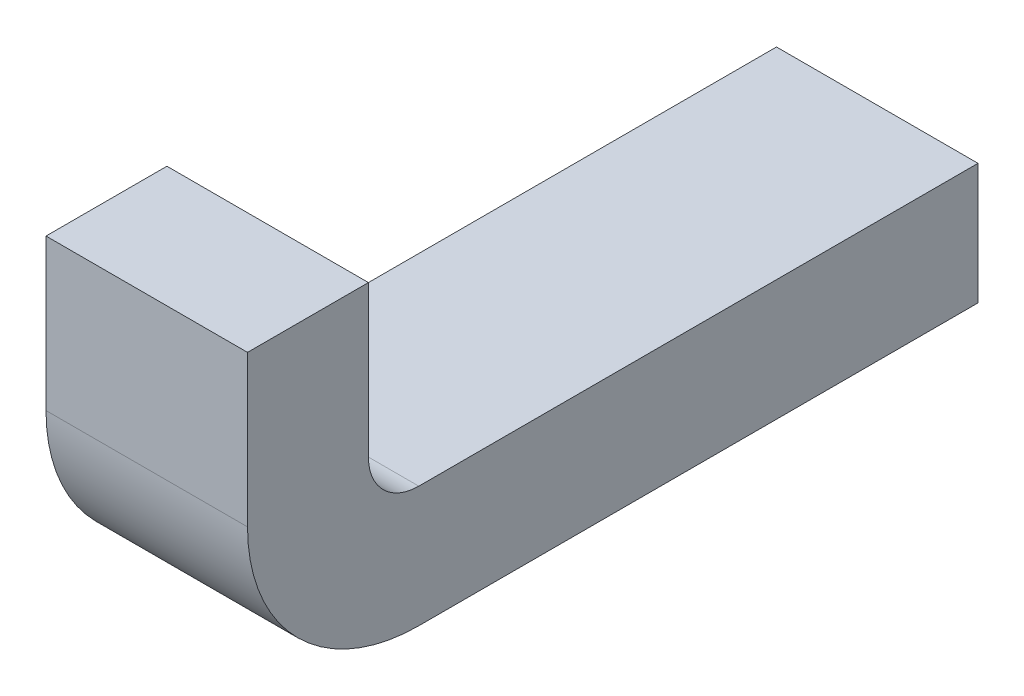
ISO-10303-21;
HEADER;
FILE_DESCRIPTION(('STEP AP214'),'2;1');
FILE_NAME('part.step','',(''),(''),'','','');
FILE_SCHEMA(('AUTOMOTIVE_DESIGN { 1 0 10303 214 1 1 1 1 }'));
ENDSEC;
DATA;
#1=APPLICATION_CONTEXT('core data for automotive mechanical design processes');
#2=APPLICATION_PROTOCOL_DEFINITION('international standard','automotive_design',2000,#1);
#3=PRODUCT_CONTEXT('',#1,'mechanical');
#4=PRODUCT('Part','Part','',(#3));
#5=PRODUCT_RELATED_PRODUCT_CATEGORY('part','',(#4));
#6=PRODUCT_DEFINITION_FORMATION('','',#4);
#7=PRODUCT_DEFINITION_CONTEXT('part definition',#1,'design');
#8=PRODUCT_DEFINITION('design','',#6,#7);
#9=PRODUCT_DEFINITION_SHAPE('','',#8);
#10=(LENGTH_UNIT() NAMED_UNIT(*) SI_UNIT(.MILLI.,.METRE.));
#11=(NAMED_UNIT(*) PLANE_ANGLE_UNIT() SI_UNIT($,.RADIAN.));
#12=(NAMED_UNIT(*) SI_UNIT($,.STERADIAN.) SOLID_ANGLE_UNIT());
#13=UNCERTAINTY_MEASURE_WITH_UNIT(LENGTH_MEASURE(1.E-05),#10,'distance_accuracy_value','');
#14=(GEOMETRIC_REPRESENTATION_CONTEXT(3) GLOBAL_UNCERTAINTY_ASSIGNED_CONTEXT((#13)) GLOBAL_UNIT_ASSIGNED_CONTEXT((#10,
#11,#12)) REPRESENTATION_CONTEXT('',''));
#15=CARTESIAN_POINT('',(0.,0.,0.));
#16=DIRECTION('',(0.,0.,1.));
#17=DIRECTION('',(1.,0.,0.));
#18=AXIS2_PLACEMENT_3D('',#15,#16,#17);
#19=CARTESIAN_POINT('',(-1.85,0.,-3.300000000002));
#20=DIRECTION('',(0.,-1.,0.));
#21=DIRECTION('',(1.,0.,0.));
#22=AXIS2_PLACEMENT_3D('',#19,#20,#21);
#23=PLANE('',#22);
#24=DIRECTION('',(0.,0.,1.));
#25=VECTOR('',#24,1.);
#26=CARTESIAN_POINT('',(-1.85,0.,-3.300000000002));
#27=LINE('',#26,#25);
#28=CARTESIAN_POINT('',(-1.85,0.,-3.300000000002));
#29=VERTEX_POINT('',#28);
#30=CARTESIAN_POINT('',(-1.85,0.,-3.854999999999));
#31=VERTEX_POINT('',#30);
#32=EDGE_CURVE('E121',#29,#31,#27,.F.);
#33=ORIENTED_EDGE('',*,*,#32,.T.);
#34=DIRECTION('',(-1.,0.,0.));
#35=VECTOR('',#34,1.);
#36=CARTESIAN_POINT('',(-1.85,0.,-3.854999999999));
#37=LINE('',#36,#35);
#38=CARTESIAN_POINT('',(-1.65,0.,-3.854999999999));
#39=VERTEX_POINT('',#38);
#40=EDGE_CURVE('E124',#39,#31,#37,.T.);
#41=ORIENTED_EDGE('',*,*,#40,.F.);
#42=DIRECTION('',(0.,0.,1.));
#43=VECTOR('',#42,1.);
#44=CARTESIAN_POINT('',(-1.65,0.,-3.300000000002));
#45=LINE('',#44,#43);
#46=CARTESIAN_POINT('',(-1.65,0.,-3.300000000002));
#47=VERTEX_POINT('',#46);
#48=EDGE_CURVE('E154',#47,#39,#45,.F.);
#49=ORIENTED_EDGE('',*,*,#48,.F.);
#50=DIRECTION('',(1.,0.,0.));
#51=VECTOR('',#50,1.);
#52=CARTESIAN_POINT('',(-1.85,0.,-3.300000000002));
#53=LINE('',#52,#51);
#54=EDGE_CURVE('E63',#29,#47,#53,.T.);
#55=ORIENTED_EDGE('',*,*,#54,.F.);
#56=EDGE_LOOP('',(#33,#41,#49,#55));
#57=FACE_BOUND('',#56,.T.);
#58=ADVANCED_FACE('F16',(#57),#23,.T.);
#59=CARTESIAN_POINT('',(-1.85,0.32,-3.250000000002));
#60=DIRECTION('',(0.,1.,1.246832498358E-13));
#61=DIRECTION('',(0.,-1.246832498358E-13,1.));
#62=AXIS2_PLACEMENT_3D('',#59,#60,#61);
#63=PLANE('',#62);
#64=DIRECTION('',(0.,0.,1.));
#65=VECTOR('',#64,1.);
#66=CARTESIAN_POINT('',(-1.85,0.32,-3.300000000002));
#67=LINE('',#66,#65);
#68=CARTESIAN_POINT('',(-1.85,0.32,-3.250000000002));
#69=VERTEX_POINT('',#68);
#70=CARTESIAN_POINT('',(-1.85,0.32,-3.130000000002));
#71=VERTEX_POINT('',#70);
#72=EDGE_CURVE('E100',#69,#71,#67,.T.);
#73=ORIENTED_EDGE('',*,*,#72,.T.);
#74=DIRECTION('',(1.,0.,0.));
#75=VECTOR('',#74,1.);
#76=CARTESIAN_POINT('',(-1.85,0.32,-3.130000000002));
#77=LINE('',#76,#75);
#78=CARTESIAN_POINT('',(-1.65,0.32,-3.130000000002));
#79=VERTEX_POINT('',#78);
#80=EDGE_CURVE('E162',#79,#71,#77,.F.);
#81=ORIENTED_EDGE('',*,*,#80,.F.);
#82=DIRECTION('',(0.,0.,1.));
#83=VECTOR('',#82,1.);
#84=CARTESIAN_POINT('',(-1.65,0.32,-3.300000000002));
#85=LINE('',#84,#83);
#86=CARTESIAN_POINT('',(-1.65,0.32,-3.250000000002));
#87=VERTEX_POINT('',#86);
#88=EDGE_CURVE('E150',#87,#79,#85,.T.);
#89=ORIENTED_EDGE('',*,*,#88,.F.);
#90=DIRECTION('',(-1.,0.,0.));
#91=VECTOR('',#90,1.);
#92=CARTESIAN_POINT('',(-1.85,0.32,-3.250000000002));
#93=LINE('',#92,#91);
#94=EDGE_CURVE('E72',#69,#87,#93,.F.);
#95=ORIENTED_EDGE('',*,*,#94,.F.);
#96=EDGE_LOOP('',(#73,#81,#89,#95));
#97=FACE_BOUND('',#96,.T.);
#98=ADVANCED_FACE('F182',(#97),#63,.T.);
#99=CARTESIAN_POINT('',(-1.85,0.32,-3.130000000002));
#100=DIRECTION('',(0.,0.,1.));
#101=DIRECTION('',(1.,0.,0.));
#102=AXIS2_PLACEMENT_3D('',#99,#100,#101);
#103=PLANE('',#102);
#104=DIRECTION('',(0.,1.,0.));
#105=VECTOR('',#104,1.);
#106=CARTESIAN_POINT('',(-1.85,0.17,-3.130000000002));
#107=LINE('',#106,#105);
#108=CARTESIAN_POINT('',(-1.85,0.17,-3.130000000002));
#109=VERTEX_POINT('',#108);
#110=EDGE_CURVE('E110',#71,#109,#107,.F.);
#111=ORIENTED_EDGE('',*,*,#110,.T.);
#112=DIRECTION('',(1.,0.,0.));
#113=VECTOR('',#112,1.);
#114=CARTESIAN_POINT('',(-1.85,0.17,-3.130000000002));
#115=LINE('',#114,#113);
#116=CARTESIAN_POINT('',(-1.65,0.17,-3.130000000002));
#117=VERTEX_POINT('',#116);
#118=EDGE_CURVE('E57',#117,#109,#115,.F.);
#119=ORIENTED_EDGE('',*,*,#118,.F.);
#120=DIRECTION('',(0.,1.,0.));
#121=VECTOR('',#120,1.);
#122=CARTESIAN_POINT('',(-1.65,0.17,-3.130000000002));
#123=LINE('',#122,#121);
#124=EDGE_CURVE('E141',#79,#117,#123,.F.);
#125=ORIENTED_EDGE('',*,*,#124,.F.);
#126=ORIENTED_EDGE('',*,*,#80,.T.);
#127=EDGE_LOOP('',(#111,#119,#125,#126));
#128=FACE_BOUND('',#127,.T.);
#129=ADVANCED_FACE('F183',(#128),#103,.T.);
#130=CARTESIAN_POINT('',(-1.85,0.17,-3.300000000002));
#131=DIRECTION('',(1.,0.,0.));
#132=DIRECTION('',(0.,1.,0.));
#133=AXIS2_PLACEMENT_3D('',#130,#131,#132);
#134=CYLINDRICAL_SURFACE('',#133,0.17);
#135=CARTESIAN_POINT('',(-1.85,0.17,-3.300000000002));
#136=DIRECTION('',(1.,0.,0.));
#137=DIRECTION('',(0.,1.,0.));
#138=AXIS2_PLACEMENT_3D('',#135,#136,#137);
#139=CIRCLE('',#138,0.17);
#140=EDGE_CURVE('E96',#109,#29,#139,.T.);
#141=ORIENTED_EDGE('',*,*,#140,.T.);
#142=ORIENTED_EDGE('',*,*,#54,.T.);
#143=CARTESIAN_POINT('',(-1.65,0.17,-3.300000000002));
#144=DIRECTION('',(1.,0.,0.));
#145=DIRECTION('',(0.,1.,0.));
#146=AXIS2_PLACEMENT_3D('',#143,#144,#145);
#147=CIRCLE('',#146,0.17);
#148=EDGE_CURVE('E19',#117,#47,#147,.T.);
#149=ORIENTED_EDGE('',*,*,#148,.F.);
#150=ORIENTED_EDGE('',*,*,#118,.T.);
#151=EDGE_LOOP('',(#141,#142,#149,#150));
#152=FACE_BOUND('',#151,.T.);
#153=ADVANCED_FACE('F185',(#152),#134,.T.);
#154=CARTESIAN_POINT('',(-1.85,0.17,-3.250000000002));
#155=DIRECTION('',(0.,0.,-1.));
#156=DIRECTION('',(-1.,0.,0.));
#157=AXIS2_PLACEMENT_3D('',#154,#155,#156);
#158=PLANE('',#157);
#159=DIRECTION('',(0.,1.,0.));
#160=VECTOR('',#159,1.);
#161=CARTESIAN_POINT('',(-1.85,0.17,-3.250000000002));
#162=LINE('',#161,#160);
#163=CARTESIAN_POINT('',(-1.85,0.17,-3.250000000002));
#164=VERTEX_POINT('',#163);
#165=EDGE_CURVE('E92',#164,#69,#162,.T.);
#166=ORIENTED_EDGE('',*,*,#165,.T.);
#167=ORIENTED_EDGE('',*,*,#94,.T.);
#168=DIRECTION('',(0.,1.,0.));
#169=VECTOR('',#168,1.);
#170=CARTESIAN_POINT('',(-1.65,0.17,-3.250000000002));
#171=LINE('',#170,#169);
#172=CARTESIAN_POINT('',(-1.65,0.17,-3.250000000002));
#173=VERTEX_POINT('',#172);
#174=EDGE_CURVE('E87',#173,#87,#171,.T.);
#175=ORIENTED_EDGE('',*,*,#174,.F.);
#176=DIRECTION('',(1.,0.,0.));
#177=VECTOR('',#176,1.);
#178=CARTESIAN_POINT('',(-1.85,0.17,-3.250000000002));
#179=LINE('',#178,#177);
#180=EDGE_CURVE('E90',#173,#164,#179,.F.);
#181=ORIENTED_EDGE('',*,*,#180,.T.);
#182=EDGE_LOOP('',(#166,#167,#175,#181));
#183=FACE_BOUND('',#182,.T.);
#184=ADVANCED_FACE('F91',(#183),#158,.T.);
#185=CARTESIAN_POINT('',(-1.65,0.17,-3.300000000002));
#186=DIRECTION('',(1.,0.,0.));
#187=DIRECTION('',(0.,1.,0.));
#188=AXIS2_PLACEMENT_3D('',#185,#186,#187);
#189=PLANE('',#188);
#190=ORIENTED_EDGE('',*,*,#88,.T.);
#191=ORIENTED_EDGE('',*,*,#124,.T.);
#192=ORIENTED_EDGE('',*,*,#148,.T.);
#193=ORIENTED_EDGE('',*,*,#48,.T.);
#194=DIRECTION('',(0.,1.,0.));
#195=VECTOR('',#194,1.);
#196=CARTESIAN_POINT('',(-1.65,0.,-3.854999999999));
#197=LINE('',#196,#195);
#198=CARTESIAN_POINT('',(-1.65,0.12,-3.854999999999));
#199=VERTEX_POINT('',#198);
#200=EDGE_CURVE('E138',#199,#39,#197,.F.);
#201=ORIENTED_EDGE('',*,*,#200,.F.);
#202=DIRECTION('',(0.,0.,1.));
#203=VECTOR('',#202,1.);
#204=CARTESIAN_POINT('',(-1.65,0.12,-3.854999999999));
#205=LINE('',#204,#203);
#206=CARTESIAN_POINT('',(-1.65,0.119999999999999,-3.300000000002));
#207=VERTEX_POINT('',#206);
#208=EDGE_CURVE('E107',#207,#199,#205,.F.);
#209=ORIENTED_EDGE('',*,*,#208,.F.);
#210=CARTESIAN_POINT('',(-1.65,0.17,-3.300000000002));
#211=DIRECTION('',(1.,0.,0.));
#212=DIRECTION('',(0.,1.,0.));
#213=AXIS2_PLACEMENT_3D('',#210,#211,#212);
#214=CIRCLE('',#213,0.05);
#215=EDGE_CURVE('E105',#207,#173,#214,.F.);
#216=ORIENTED_EDGE('',*,*,#215,.T.);
#217=ORIENTED_EDGE('',*,*,#174,.T.);
#218=EDGE_LOOP('',(#190,#191,#192,#193,#201,#209,#216,#217));
#219=FACE_BOUND('',#218,.T.);
#220=ADVANCED_FACE('F179',(#219),#189,.T.);
#221=CARTESIAN_POINT('',(-1.85,0.,-3.854999999999));
#222=DIRECTION('',(0.,0.,-1.));
#223=DIRECTION('',(-1.,0.,0.));
#224=AXIS2_PLACEMENT_3D('',#221,#222,#223);
#225=PLANE('',#224);
#226=DIRECTION('',(0.,1.,0.));
#227=VECTOR('',#226,1.);
#228=CARTESIAN_POINT('',(-1.85,0.17,-3.854999999999));
#229=LINE('',#228,#227);
#230=CARTESIAN_POINT('',(-1.85,0.12,-3.854999999999));
#231=VERTEX_POINT('',#230);
#232=EDGE_CURVE('E101',#31,#231,#229,.T.);
#233=ORIENTED_EDGE('',*,*,#232,.T.);
#234=DIRECTION('',(-1.,0.,0.));
#235=VECTOR('',#234,1.);
#236=CARTESIAN_POINT('',(-1.85,0.12,-3.854999999999));
#237=LINE('',#236,#235);
#238=EDGE_CURVE('E128',#199,#231,#237,.T.);
#239=ORIENTED_EDGE('',*,*,#238,.F.);
#240=ORIENTED_EDGE('',*,*,#200,.T.);
#241=ORIENTED_EDGE('',*,*,#40,.T.);
#242=EDGE_LOOP('',(#233,#239,#240,#241));
#243=FACE_BOUND('',#242,.T.);
#244=ADVANCED_FACE('F204',(#243),#225,.T.);
#245=CARTESIAN_POINT('',(-1.85,0.17,-3.300000000002));
#246=DIRECTION('',(1.,0.,0.));
#247=DIRECTION('',(0.,1.,0.));
#248=AXIS2_PLACEMENT_3D('',#245,#246,#247);
#249=PLANE('',#248);
#250=ORIENTED_EDGE('',*,*,#110,.F.);
#251=ORIENTED_EDGE('',*,*,#72,.F.);
#252=ORIENTED_EDGE('',*,*,#165,.F.);
#253=CARTESIAN_POINT('',(-1.85,0.17,-3.300000000002));
#254=DIRECTION('',(1.,0.,0.));
#255=DIRECTION('',(0.,1.,0.));
#256=AXIS2_PLACEMENT_3D('',#253,#254,#255);
#257=CIRCLE('',#256,0.05);
#258=CARTESIAN_POINT('',(-1.85,0.12,-3.300000000002));
#259=VERTEX_POINT('',#258);
#260=EDGE_CURVE('E34',#164,#259,#257,.T.);
#261=ORIENTED_EDGE('',*,*,#260,.T.);
#262=DIRECTION('',(0.,0.,1.));
#263=VECTOR('',#262,1.);
#264=CARTESIAN_POINT('',(-1.85,0.12,-3.854999999999));
#265=LINE('',#264,#263);
#266=EDGE_CURVE('E25',#231,#259,#265,.T.);
#267=ORIENTED_EDGE('',*,*,#266,.F.);
#268=ORIENTED_EDGE('',*,*,#232,.F.);
#269=ORIENTED_EDGE('',*,*,#32,.F.);
#270=ORIENTED_EDGE('',*,*,#140,.F.);
#271=EDGE_LOOP('',(#250,#251,#252,#261,#267,#268,#269,#270));
#272=FACE_BOUND('',#271,.T.);
#273=ADVANCED_FACE('F99',(#272),#249,.F.);
#274=CARTESIAN_POINT('',(-1.85,0.17,-3.300000000002));
#275=DIRECTION('',(1.,0.,0.));
#276=DIRECTION('',(0.,1.,0.));
#277=AXIS2_PLACEMENT_3D('',#274,#275,#276);
#278=CYLINDRICAL_SURFACE('',#277,0.05);
#279=DIRECTION('',(-1.,0.,0.));
#280=VECTOR('',#279,1.);
#281=CARTESIAN_POINT('',(-1.85,0.12,-3.300000000002));
#282=LINE('',#281,#280);
#283=EDGE_CURVE('E11',#259,#207,#282,.F.);
#284=ORIENTED_EDGE('',*,*,#283,.F.);
#285=ORIENTED_EDGE('',*,*,#260,.F.);
#286=ORIENTED_EDGE('',*,*,#180,.F.);
#287=ORIENTED_EDGE('',*,*,#215,.F.);
#288=EDGE_LOOP('',(#284,#285,#286,#287));
#289=FACE_BOUND('',#288,.T.);
#290=ADVANCED_FACE('F103',(#289),#278,.F.);
#291=CARTESIAN_POINT('',(-1.85,0.12,-3.854999999999));
#292=DIRECTION('',(0.,1.,0.));
#293=DIRECTION('',(-1.,0.,0.));
#294=AXIS2_PLACEMENT_3D('',#291,#292,#293);
#295=PLANE('',#294);
#296=ORIENTED_EDGE('',*,*,#266,.T.);
#297=ORIENTED_EDGE('',*,*,#283,.T.);
#298=ORIENTED_EDGE('',*,*,#208,.T.);
#299=ORIENTED_EDGE('',*,*,#238,.T.);
#300=EDGE_LOOP('',(#296,#297,#298,#299));
#301=FACE_BOUND('',#300,.T.);
#302=ADVANCED_FACE('F193',(#301),#295,.T.);
#303=CLOSED_SHELL('',(#58,#98,#129,#153,#184,#220,#244,#273,#290,#302));
#304=MANIFOLD_SOLID_BREP('B1',#303);
#305=ADVANCED_BREP_SHAPE_REPRESENTATION('',(#18,#304),#14);
#306=SHAPE_DEFINITION_REPRESENTATION(#9,#305);
ENDSEC;
END-ISO-10303-21;
